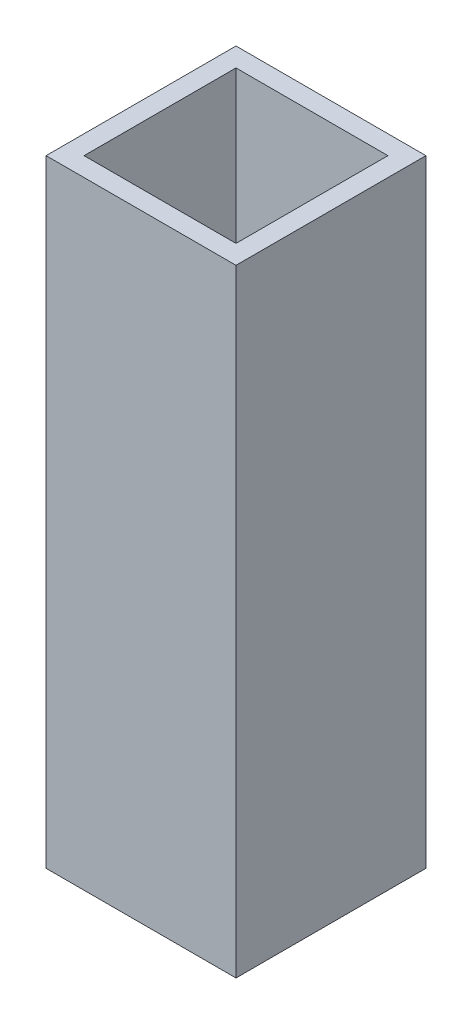
ISO-10303-21;
HEADER;
FILE_DESCRIPTION(('STEP AP214'),'2;1');
FILE_NAME('part.step','',(''),(''),'','','');
FILE_SCHEMA(('AUTOMOTIVE_DESIGN { 1 0 10303 214 1 1 1 1 }'));
ENDSEC;
DATA;
#1=APPLICATION_CONTEXT('core data for automotive mechanical design processes');
#2=APPLICATION_PROTOCOL_DEFINITION('international standard','automotive_design',2000,#1);
#3=PRODUCT_CONTEXT('',#1,'mechanical');
#4=PRODUCT('Part','Part','',(#3));
#5=PRODUCT_RELATED_PRODUCT_CATEGORY('part','',(#4));
#6=PRODUCT_DEFINITION_FORMATION('','',#4);
#7=PRODUCT_DEFINITION_CONTEXT('part definition',#1,'design');
#8=PRODUCT_DEFINITION('design','',#6,#7);
#9=PRODUCT_DEFINITION_SHAPE('','',#8);
#10=(LENGTH_UNIT() NAMED_UNIT(*) SI_UNIT(.MILLI.,.METRE.));
#11=(NAMED_UNIT(*) PLANE_ANGLE_UNIT() SI_UNIT($,.RADIAN.));
#12=(NAMED_UNIT(*) SI_UNIT($,.STERADIAN.) SOLID_ANGLE_UNIT());
#13=UNCERTAINTY_MEASURE_WITH_UNIT(LENGTH_MEASURE(1.E-05),#10,'distance_accuracy_value','');
#14=(GEOMETRIC_REPRESENTATION_CONTEXT(3) GLOBAL_UNCERTAINTY_ASSIGNED_CONTEXT((#13)) GLOBAL_UNIT_ASSIGNED_CONTEXT((#10,
#11,#12)) REPRESENTATION_CONTEXT('',''));
#15=CARTESIAN_POINT('',(0.,0.,0.));
#16=DIRECTION('',(0.,0.,1.));
#17=DIRECTION('',(1.,0.,0.));
#18=AXIS2_PLACEMENT_3D('',#15,#16,#17);
#19=CARTESIAN_POINT('',(0.,82.55,0.));
#20=DIRECTION('',(0.,1.,0.));
#21=DIRECTION('',(0.,0.,1.));
#22=AXIS2_PLACEMENT_3D('',#19,#20,#21);
#23=PLANE('',#22);
#24=DIRECTION('',(0.,0.,1.));
#25=VECTOR('',#24,1.);
#26=CARTESIAN_POINT('',(0.,82.55,0.));
#27=LINE('',#26,#25);
#28=CARTESIAN_POINT('',(0.,82.55,-25.4));
#29=VERTEX_POINT('',#28);
#30=CARTESIAN_POINT('',(0.,82.55,0.));
#31=VERTEX_POINT('',#30);
#32=EDGE_CURVE('E158',#29,#31,#27,.T.);
#33=ORIENTED_EDGE('',*,*,#32,.T.);
#34=DIRECTION('',(1.,0.,0.));
#35=VECTOR('',#34,1.);
#36=CARTESIAN_POINT('',(0.,82.55,0.));
#37=LINE('',#36,#35);
#38=CARTESIAN_POINT('',(25.4,82.55,0.));
#39=VERTEX_POINT('',#38);
#40=EDGE_CURVE('E161',#31,#39,#37,.T.);
#41=ORIENTED_EDGE('',*,*,#40,.T.);
#42=DIRECTION('',(0.,0.,-1.));
#43=VECTOR('',#42,1.);
#44=CARTESIAN_POINT('',(25.4,82.55,0.));
#45=LINE('',#44,#43);
#46=CARTESIAN_POINT('',(25.4,82.55,-25.4));
#47=VERTEX_POINT('',#46);
#48=EDGE_CURVE('E164',#39,#47,#45,.T.);
#49=ORIENTED_EDGE('',*,*,#48,.T.);
#50=DIRECTION('',(-1.,0.,0.));
#51=VECTOR('',#50,1.);
#52=CARTESIAN_POINT('',(0.,82.55,-25.4));
#53=LINE('',#52,#51);
#54=EDGE_CURVE('E166',#47,#29,#53,.T.);
#55=ORIENTED_EDGE('',*,*,#54,.T.);
#56=EDGE_LOOP('',(#33,#41,#49,#55));
#57=FACE_BOUND('',#56,.T.);
#58=DIRECTION('',(1.,0.,0.));
#59=VECTOR('',#58,1.);
#60=CARTESIAN_POINT('',(0.,82.55,-2.54));
#61=LINE('',#60,#59);
#62=CARTESIAN_POINT('',(2.54,82.55,-2.54));
#63=VERTEX_POINT('',#62);
#64=CARTESIAN_POINT('',(22.86,82.55,-2.54));
#65=VERTEX_POINT('',#64);
#66=EDGE_CURVE('E130',#63,#65,#61,.T.);
#67=ORIENTED_EDGE('',*,*,#66,.F.);
#68=DIRECTION('',(0.,0.,1.));
#69=VECTOR('',#68,1.);
#70=CARTESIAN_POINT('',(2.54,82.55,0.));
#71=LINE('',#70,#69);
#72=CARTESIAN_POINT('',(2.54,82.55,-22.86));
#73=VERTEX_POINT('',#72);
#74=EDGE_CURVE('E122',#73,#63,#71,.T.);
#75=ORIENTED_EDGE('',*,*,#74,.F.);
#76=DIRECTION('',(-1.,0.,0.));
#77=VECTOR('',#76,1.);
#78=CARTESIAN_POINT('',(0.,82.55,-22.86));
#79=LINE('',#78,#77);
#80=CARTESIAN_POINT('',(22.86,82.55,-22.86));
#81=VERTEX_POINT('',#80);
#82=EDGE_CURVE('E144',#81,#73,#79,.T.);
#83=ORIENTED_EDGE('',*,*,#82,.F.);
#84=DIRECTION('',(0.,0.,-1.));
#85=VECTOR('',#84,1.);
#86=CARTESIAN_POINT('',(22.86,82.55,0.));
#87=LINE('',#86,#85);
#88=EDGE_CURVE('E142',#65,#81,#87,.T.);
#89=ORIENTED_EDGE('',*,*,#88,.F.);
#90=EDGE_LOOP('',(#67,#75,#83,#89));
#91=FACE_BOUND('',#90,.T.);
#92=ADVANCED_FACE('F57',(#57,#91),#23,.T.);
#93=CARTESIAN_POINT('',(0.,0.,0.));
#94=DIRECTION('',(0.,1.,0.));
#95=DIRECTION('',(0.,0.,1.));
#96=AXIS2_PLACEMENT_3D('',#93,#94,#95);
#97=PLANE('',#96);
#98=DIRECTION('',(0.,0.,1.));
#99=VECTOR('',#98,1.);
#100=CARTESIAN_POINT('',(0.,0.,0.));
#101=LINE('',#100,#99);
#102=CARTESIAN_POINT('',(0.,0.,-25.4));
#103=VERTEX_POINT('',#102);
#104=CARTESIAN_POINT('',(0.,0.,0.));
#105=VERTEX_POINT('',#104);
#106=EDGE_CURVE('E138',#103,#105,#101,.T.);
#107=ORIENTED_EDGE('',*,*,#106,.F.);
#108=DIRECTION('',(-1.,0.,0.));
#109=VECTOR('',#108,1.);
#110=CARTESIAN_POINT('',(0.,0.,-25.4));
#111=LINE('',#110,#109);
#112=CARTESIAN_POINT('',(25.4,0.,-25.4));
#113=VERTEX_POINT('',#112);
#114=EDGE_CURVE('E162',#113,#103,#111,.T.);
#115=ORIENTED_EDGE('',*,*,#114,.F.);
#116=DIRECTION('',(0.,0.,-1.));
#117=VECTOR('',#116,1.);
#118=CARTESIAN_POINT('',(25.4,0.,0.));
#119=LINE('',#118,#117);
#120=CARTESIAN_POINT('',(25.4,0.,0.));
#121=VERTEX_POINT('',#120);
#122=EDGE_CURVE('E173',#121,#113,#119,.T.);
#123=ORIENTED_EDGE('',*,*,#122,.F.);
#124=DIRECTION('',(1.,0.,0.));
#125=VECTOR('',#124,1.);
#126=CARTESIAN_POINT('',(0.,0.,0.));
#127=LINE('',#126,#125);
#128=EDGE_CURVE('E171',#105,#121,#127,.T.);
#129=ORIENTED_EDGE('',*,*,#128,.F.);
#130=EDGE_LOOP('',(#107,#115,#123,#129));
#131=FACE_BOUND('',#130,.T.);
#132=DIRECTION('',(0.,0.,1.));
#133=VECTOR('',#132,1.);
#134=CARTESIAN_POINT('',(2.54,0.,0.));
#135=LINE('',#134,#133);
#136=CARTESIAN_POINT('',(2.54,0.,-22.86));
#137=VERTEX_POINT('',#136);
#138=CARTESIAN_POINT('',(2.54,0.,-2.54));
#139=VERTEX_POINT('',#138);
#140=EDGE_CURVE('E80',#137,#139,#135,.T.);
#141=ORIENTED_EDGE('',*,*,#140,.T.);
#142=DIRECTION('',(1.,0.,0.));
#143=VECTOR('',#142,1.);
#144=CARTESIAN_POINT('',(0.,0.,-2.54));
#145=LINE('',#144,#143);
#146=CARTESIAN_POINT('',(22.86,0.,-2.54));
#147=VERTEX_POINT('',#146);
#148=EDGE_CURVE('E137',#139,#147,#145,.T.);
#149=ORIENTED_EDGE('',*,*,#148,.T.);
#150=DIRECTION('',(0.,0.,-1.));
#151=VECTOR('',#150,1.);
#152=CARTESIAN_POINT('',(22.86,0.,0.));
#153=LINE('',#152,#151);
#154=CARTESIAN_POINT('',(22.86,0.,-22.86));
#155=VERTEX_POINT('',#154);
#156=EDGE_CURVE('E150',#147,#155,#153,.T.);
#157=ORIENTED_EDGE('',*,*,#156,.T.);
#158=DIRECTION('',(-1.,0.,0.));
#159=VECTOR('',#158,1.);
#160=CARTESIAN_POINT('',(0.,0.,-22.86));
#161=LINE('',#160,#159);
#162=EDGE_CURVE('E131',#155,#137,#161,.T.);
#163=ORIENTED_EDGE('',*,*,#162,.T.);
#164=EDGE_LOOP('',(#141,#149,#157,#163));
#165=FACE_BOUND('',#164,.T.);
#166=ADVANCED_FACE('F191',(#131,#165),#97,.F.);
#167=CARTESIAN_POINT('',(0.,82.55,0.));
#168=DIRECTION('',(1.,0.,0.));
#169=DIRECTION('',(0.,0.,-1.));
#170=AXIS2_PLACEMENT_3D('',#167,#168,#169);
#171=PLANE('',#170);
#172=ORIENTED_EDGE('',*,*,#106,.T.);
#173=DIRECTION('',(0.,-1.,0.));
#174=VECTOR('',#173,1.);
#175=CARTESIAN_POINT('',(0.,82.55,0.));
#176=LINE('',#175,#174);
#177=EDGE_CURVE('E12',#31,#105,#176,.T.);
#178=ORIENTED_EDGE('',*,*,#177,.F.);
#179=ORIENTED_EDGE('',*,*,#32,.F.);
#180=DIRECTION('',(0.,-1.,0.));
#181=VECTOR('',#180,1.);
#182=CARTESIAN_POINT('',(0.,82.55,-25.4));
#183=LINE('',#182,#181);
#184=EDGE_CURVE('E168',#29,#103,#183,.T.);
#185=ORIENTED_EDGE('',*,*,#184,.T.);
#186=EDGE_LOOP('',(#172,#178,#179,#185));
#187=FACE_BOUND('',#186,.T.);
#188=ADVANCED_FACE('F59',(#187),#171,.F.);
#189=CARTESIAN_POINT('',(0.,82.55,0.));
#190=DIRECTION('',(0.,0.,-1.));
#191=DIRECTION('',(-1.,0.,0.));
#192=AXIS2_PLACEMENT_3D('',#189,#190,#191);
#193=PLANE('',#192);
#194=ORIENTED_EDGE('',*,*,#128,.T.);
#195=DIRECTION('',(0.,-1.,0.));
#196=VECTOR('',#195,1.);
#197=CARTESIAN_POINT('',(25.4,82.55,0.));
#198=LINE('',#197,#196);
#199=EDGE_CURVE('E65',#39,#121,#198,.T.);
#200=ORIENTED_EDGE('',*,*,#199,.F.);
#201=ORIENTED_EDGE('',*,*,#40,.F.);
#202=ORIENTED_EDGE('',*,*,#177,.T.);
#203=EDGE_LOOP('',(#194,#200,#201,#202));
#204=FACE_BOUND('',#203,.T.);
#205=ADVANCED_FACE('F201',(#204),#193,.F.);
#206=CARTESIAN_POINT('',(25.4,82.55,0.));
#207=DIRECTION('',(-1.,0.,0.));
#208=DIRECTION('',(0.,0.,1.));
#209=AXIS2_PLACEMENT_3D('',#206,#207,#208);
#210=PLANE('',#209);
#211=ORIENTED_EDGE('',*,*,#122,.T.);
#212=DIRECTION('',(0.,-1.,0.));
#213=VECTOR('',#212,1.);
#214=CARTESIAN_POINT('',(25.4,82.55,-25.4));
#215=LINE('',#214,#213);
#216=EDGE_CURVE('E178',#47,#113,#215,.T.);
#217=ORIENTED_EDGE('',*,*,#216,.F.);
#218=ORIENTED_EDGE('',*,*,#48,.F.);
#219=ORIENTED_EDGE('',*,*,#199,.T.);
#220=EDGE_LOOP('',(#211,#217,#218,#219));
#221=FACE_BOUND('',#220,.T.);
#222=ADVANCED_FACE('F185',(#221),#210,.F.);
#223=CARTESIAN_POINT('',(0.,82.55,-25.4));
#224=DIRECTION('',(0.,0.,1.));
#225=DIRECTION('',(1.,0.,0.));
#226=AXIS2_PLACEMENT_3D('',#223,#224,#225);
#227=PLANE('',#226);
#228=ORIENTED_EDGE('',*,*,#114,.T.);
#229=ORIENTED_EDGE('',*,*,#184,.F.);
#230=ORIENTED_EDGE('',*,*,#54,.F.);
#231=ORIENTED_EDGE('',*,*,#216,.T.);
#232=EDGE_LOOP('',(#228,#229,#230,#231));
#233=FACE_BOUND('',#232,.T.);
#234=ADVANCED_FACE('F195',(#233),#227,.F.);
#235=CARTESIAN_POINT('',(2.54,82.55,0.));
#236=DIRECTION('',(1.,0.,0.));
#237=DIRECTION('',(0.,0.,-1.));
#238=AXIS2_PLACEMENT_3D('',#235,#236,#237);
#239=PLANE('',#238);
#240=ORIENTED_EDGE('',*,*,#140,.F.);
#241=DIRECTION('',(0.,-1.,0.));
#242=VECTOR('',#241,1.);
#243=CARTESIAN_POINT('',(2.54,82.55,-22.86));
#244=LINE('',#243,#242);
#245=EDGE_CURVE('E126',#73,#137,#244,.T.);
#246=ORIENTED_EDGE('',*,*,#245,.F.);
#247=ORIENTED_EDGE('',*,*,#74,.T.);
#248=DIRECTION('',(0.,-1.,0.));
#249=VECTOR('',#248,1.);
#250=CARTESIAN_POINT('',(2.54,82.55,-2.54));
#251=LINE('',#250,#249);
#252=EDGE_CURVE('E125',#63,#139,#251,.T.);
#253=ORIENTED_EDGE('',*,*,#252,.T.);
#254=EDGE_LOOP('',(#240,#246,#247,#253));
#255=FACE_BOUND('',#254,.T.);
#256=ADVANCED_FACE('F124',(#255),#239,.T.);
#257=CARTESIAN_POINT('',(0.,82.55,-2.54));
#258=DIRECTION('',(0.,0.,-1.));
#259=DIRECTION('',(-1.,0.,0.));
#260=AXIS2_PLACEMENT_3D('',#257,#258,#259);
#261=PLANE('',#260);
#262=ORIENTED_EDGE('',*,*,#148,.F.);
#263=ORIENTED_EDGE('',*,*,#252,.F.);
#264=ORIENTED_EDGE('',*,*,#66,.T.);
#265=DIRECTION('',(0.,-1.,0.));
#266=VECTOR('',#265,1.);
#267=CARTESIAN_POINT('',(22.86,82.55,-2.54));
#268=LINE('',#267,#266);
#269=EDGE_CURVE('E139',#65,#147,#268,.T.);
#270=ORIENTED_EDGE('',*,*,#269,.T.);
#271=EDGE_LOOP('',(#262,#263,#264,#270));
#272=FACE_BOUND('',#271,.T.);
#273=ADVANCED_FACE('F134',(#272),#261,.T.);
#274=CARTESIAN_POINT('',(22.86,82.55,0.));
#275=DIRECTION('',(-1.,0.,0.));
#276=DIRECTION('',(0.,0.,1.));
#277=AXIS2_PLACEMENT_3D('',#274,#275,#276);
#278=PLANE('',#277);
#279=ORIENTED_EDGE('',*,*,#156,.F.);
#280=ORIENTED_EDGE('',*,*,#269,.F.);
#281=ORIENTED_EDGE('',*,*,#88,.T.);
#282=DIRECTION('',(0.,-1.,0.));
#283=VECTOR('',#282,1.);
#284=CARTESIAN_POINT('',(22.86,82.55,-22.86));
#285=LINE('',#284,#283);
#286=EDGE_CURVE('E72',#81,#155,#285,.T.);
#287=ORIENTED_EDGE('',*,*,#286,.T.);
#288=EDGE_LOOP('',(#279,#280,#281,#287));
#289=FACE_BOUND('',#288,.T.);
#290=ADVANCED_FACE('F224',(#289),#278,.T.);
#291=CARTESIAN_POINT('',(0.,82.55,-22.86));
#292=DIRECTION('',(0.,0.,1.));
#293=DIRECTION('',(1.,0.,0.));
#294=AXIS2_PLACEMENT_3D('',#291,#292,#293);
#295=PLANE('',#294);
#296=ORIENTED_EDGE('',*,*,#162,.F.);
#297=ORIENTED_EDGE('',*,*,#286,.F.);
#298=ORIENTED_EDGE('',*,*,#82,.T.);
#299=ORIENTED_EDGE('',*,*,#245,.T.);
#300=EDGE_LOOP('',(#296,#297,#298,#299));
#301=FACE_BOUND('',#300,.T.);
#302=ADVANCED_FACE('F228',(#301),#295,.T.);
#303=CLOSED_SHELL('',(#92,#166,#188,#205,#222,#234,#256,#273,#290,#302));
#304=MANIFOLD_SOLID_BREP('B2',#303);
#305=ADVANCED_BREP_SHAPE_REPRESENTATION('',(#18,#304),#14);
#306=SHAPE_DEFINITION_REPRESENTATION(#9,#305);
ENDSEC;
END-ISO-10303-21;
